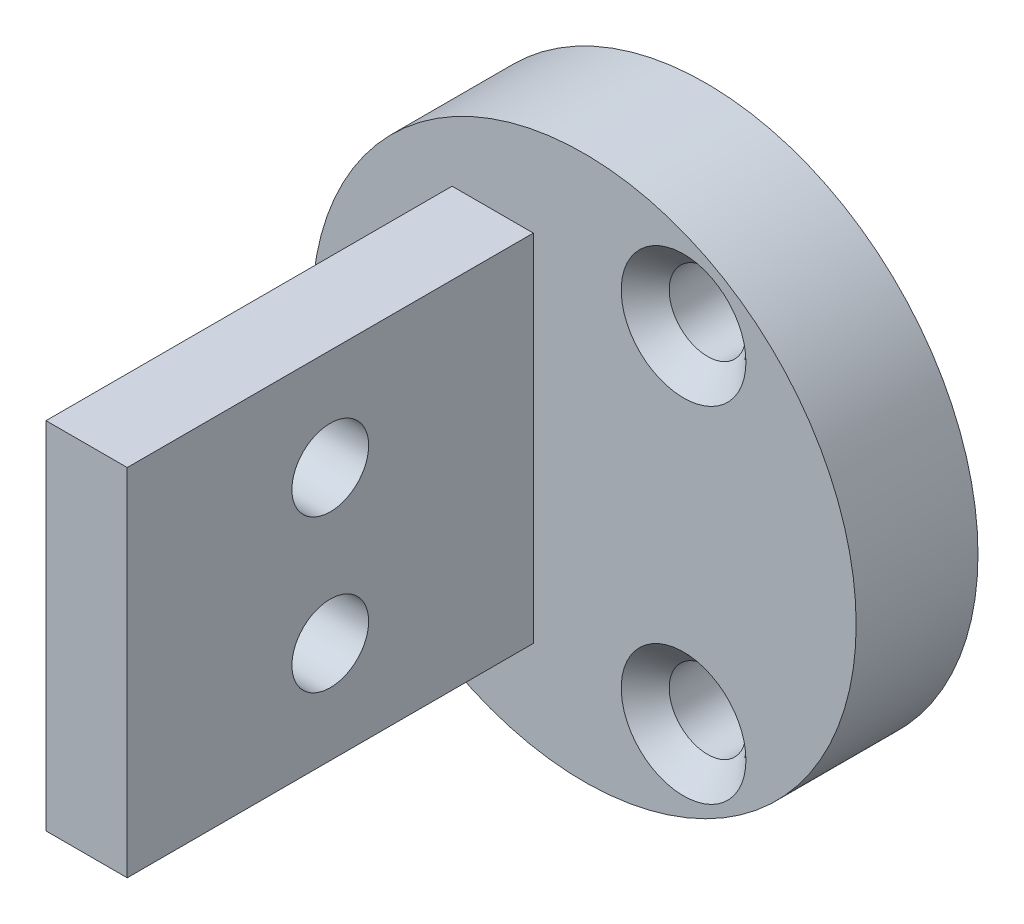
ISO-10303-21;
HEADER;
FILE_DESCRIPTION(('STEP AP214'),'2;1');
FILE_NAME('part.step','',(''),(''),'','','');
FILE_SCHEMA(('AUTOMOTIVE_DESIGN { 1 0 10303 214 1 1 1 1 }'));
ENDSEC;
DATA;
#1=APPLICATION_CONTEXT('core data for automotive mechanical design processes');
#2=APPLICATION_PROTOCOL_DEFINITION('international standard','automotive_design',2000,#1);
#3=PRODUCT_CONTEXT('',#1,'mechanical');
#4=PRODUCT('Part','Part','',(#3));
#5=PRODUCT_RELATED_PRODUCT_CATEGORY('part','',(#4));
#6=PRODUCT_DEFINITION_FORMATION('','',#4);
#7=PRODUCT_DEFINITION_CONTEXT('part definition',#1,'design');
#8=PRODUCT_DEFINITION('design','',#6,#7);
#9=PRODUCT_DEFINITION_SHAPE('','',#8);
#10=(LENGTH_UNIT() NAMED_UNIT(*) SI_UNIT(.MILLI.,.METRE.));
#11=(NAMED_UNIT(*) PLANE_ANGLE_UNIT() SI_UNIT($,.RADIAN.));
#12=(NAMED_UNIT(*) SI_UNIT($,.STERADIAN.) SOLID_ANGLE_UNIT());
#13=UNCERTAINTY_MEASURE_WITH_UNIT(LENGTH_MEASURE(1.E-05),#10,'distance_accuracy_value','');
#14=(GEOMETRIC_REPRESENTATION_CONTEXT(3) GLOBAL_UNCERTAINTY_ASSIGNED_CONTEXT((#13)) GLOBAL_UNIT_ASSIGNED_CONTEXT((#10,
#11,#12)) REPRESENTATION_CONTEXT('',''));
#15=CARTESIAN_POINT('',(0.,0.,0.));
#16=DIRECTION('',(0.,0.,1.));
#17=DIRECTION('',(1.,0.,0.));
#18=AXIS2_PLACEMENT_3D('',#15,#16,#17);
#19=CARTESIAN_POINT('',(0.,0.,3.81));
#20=DIRECTION('',(0.,0.,1.));
#21=DIRECTION('',(1.,0.,0.));
#22=AXIS2_PLACEMENT_3D('',#19,#20,#21);
#23=PLANE('',#22);
#24=CARTESIAN_POINT('',(-6.223,0.,3.81));
#25=DIRECTION('',(0.,0.,1.));
#26=DIRECTION('',(1.,0.,0.));
#27=AXIS2_PLACEMENT_3D('',#24,#25,#26);
#28=CIRCLE('',#27,1.94999999999999);
#29=CARTESIAN_POINT('',(-4.27300000000001,0.,3.81));
#30=VERTEX_POINT('',#29);
#31=EDGE_CURVE('E11',#30,#30,#28,.F.);
#32=ORIENTED_EDGE('',*,*,#31,.T.);
#33=EDGE_LOOP('',(#32));
#34=FACE_BOUND('',#33,.T.);
#35=CARTESIAN_POINT('',(3.11150000000001,5.38927608775055,3.81));
#36=DIRECTION('',(0.,0.,1.));
#37=DIRECTION('',(1.,0.,0.));
#38=AXIS2_PLACEMENT_3D('',#35,#36,#37);
#39=CIRCLE('',#38,1.94999999999999);
#40=CARTESIAN_POINT('',(5.0615,5.38927608775055,3.81));
#41=VERTEX_POINT('',#40);
#42=EDGE_CURVE('E152',#41,#41,#39,.F.);
#43=ORIENTED_EDGE('',*,*,#42,.T.);
#44=EDGE_LOOP('',(#43));
#45=FACE_BOUND('',#44,.T.);
#46=CARTESIAN_POINT('',(3.11149999999999,-5.38927608775058,3.81));
#47=DIRECTION('',(0.,0.,1.));
#48=DIRECTION('',(1.,0.,0.));
#49=AXIS2_PLACEMENT_3D('',#46,#47,#48);
#50=CIRCLE('',#49,1.94999999999999);
#51=CARTESIAN_POINT('',(5.06149999999998,-5.38927608775058,3.81));
#52=VERTEX_POINT('',#51);
#53=EDGE_CURVE('E144',#52,#52,#50,.F.);
#54=ORIENTED_EDGE('',*,*,#53,.T.);
#55=EDGE_LOOP('',(#54));
#56=FACE_BOUND('',#55,.T.);
#57=CARTESIAN_POINT('',(0.,0.,3.81));
#58=DIRECTION('',(0.,0.,1.));
#59=DIRECTION('',(1.,0.,0.));
#60=AXIS2_PLACEMENT_3D('',#57,#58,#59);
#61=CIRCLE('',#60,8.509);
#62=CARTESIAN_POINT('',(8.509,0.,3.81));
#63=VERTEX_POINT('',#62);
#64=EDGE_CURVE('E133',#63,#63,#61,.T.);
#65=ORIENTED_EDGE('',*,*,#64,.T.);
#66=EDGE_LOOP('',(#65));
#67=FACE_BOUND('',#66,.T.);
#68=DIRECTION('',(1.,0.,0.));
#69=VECTOR('',#68,1.);
#70=CARTESIAN_POINT('',(-4.1275,-5.55625,3.81));
#71=LINE('',#70,#69);
#72=CARTESIAN_POINT('',(-4.1275,-5.55625,3.81));
#73=VERTEX_POINT('',#72);
#74=CARTESIAN_POINT('',(-1.5875,-5.55625,3.81));
#75=VERTEX_POINT('',#74);
#76=EDGE_CURVE('E100',#73,#75,#71,.T.);
#77=ORIENTED_EDGE('',*,*,#76,.F.);
#78=DIRECTION('',(0.,-1.,0.));
#79=VECTOR('',#78,1.);
#80=CARTESIAN_POINT('',(-4.1275,5.55625,3.81));
#81=LINE('',#80,#79);
#82=CARTESIAN_POINT('',(-4.1275,5.55625,3.81));
#83=VERTEX_POINT('',#82);
#84=EDGE_CURVE('E114',#83,#73,#81,.T.);
#85=ORIENTED_EDGE('',*,*,#84,.F.);
#86=DIRECTION('',(-1.,0.,0.));
#87=VECTOR('',#86,1.);
#88=CARTESIAN_POINT('',(-4.1275,5.55625,3.81));
#89=LINE('',#88,#87);
#90=CARTESIAN_POINT('',(-1.5875,5.55625,3.81));
#91=VERTEX_POINT('',#90);
#92=EDGE_CURVE('E80',#91,#83,#89,.T.);
#93=ORIENTED_EDGE('',*,*,#92,.F.);
#94=DIRECTION('',(0.,1.,0.));
#95=VECTOR('',#94,1.);
#96=CARTESIAN_POINT('',(-1.5875,5.55625,3.81));
#97=LINE('',#96,#95);
#98=EDGE_CURVE('E121',#75,#91,#97,.T.);
#99=ORIENTED_EDGE('',*,*,#98,.F.);
#100=EDGE_LOOP('',(#77,#85,#93,#99));
#101=FACE_BOUND('',#100,.T.);
#102=ADVANCED_FACE('F41',(#34,#45,#56,#67,#101),#23,.T.);
#103=CARTESIAN_POINT('',(0.,0.,3.81));
#104=DIRECTION('',(0.,0.,-1.));
#105=DIRECTION('',(-1.,0.,0.));
#106=AXIS2_PLACEMENT_3D('',#103,#104,#105);
#107=CYLINDRICAL_SURFACE('',#106,8.509);
#108=ORIENTED_EDGE('',*,*,#64,.F.);
#109=EDGE_LOOP('',(#108));
#110=FACE_BOUND('',#109,.T.);
#111=CARTESIAN_POINT('',(0.,0.,0.));
#112=DIRECTION('',(0.,0.,1.));
#113=DIRECTION('',(1.,0.,0.));
#114=AXIS2_PLACEMENT_3D('',#111,#112,#113);
#115=CIRCLE('',#114,8.509);
#116=CARTESIAN_POINT('',(8.509,0.,0.));
#117=VERTEX_POINT('',#116);
#118=EDGE_CURVE('E132',#117,#117,#115,.T.);
#119=ORIENTED_EDGE('',*,*,#118,.T.);
#120=EDGE_LOOP('',(#119));
#121=FACE_BOUND('',#120,.T.);
#122=ADVANCED_FACE('F172',(#110,#121),#107,.T.);
#123=CARTESIAN_POINT('',(0.,0.,0.));
#124=DIRECTION('',(0.,0.,1.));
#125=DIRECTION('',(1.,0.,0.));
#126=AXIS2_PLACEMENT_3D('',#123,#124,#125);
#127=PLANE('',#126);
#128=CARTESIAN_POINT('',(-6.223,0.,0.));
#129=DIRECTION('',(0.,0.,1.));
#130=DIRECTION('',(1.,0.,0.));
#131=AXIS2_PLACEMENT_3D('',#128,#129,#130);
#132=CIRCLE('',#131,1.2);
#133=CARTESIAN_POINT('',(-5.023,0.,0.));
#134=VERTEX_POINT('',#133);
#135=EDGE_CURVE('E225',#134,#134,#132,.T.);
#136=ORIENTED_EDGE('',*,*,#135,.T.);
#137=EDGE_LOOP('',(#136));
#138=FACE_BOUND('',#137,.T.);
#139=CARTESIAN_POINT('',(3.11150000000001,5.38927608775055,0.));
#140=DIRECTION('',(0.,0.,1.));
#141=DIRECTION('',(1.,0.,0.));
#142=AXIS2_PLACEMENT_3D('',#139,#140,#141);
#143=CIRCLE('',#142,1.2);
#144=CARTESIAN_POINT('',(4.31150000000001,5.38927608775055,0.));
#145=VERTEX_POINT('',#144);
#146=EDGE_CURVE('E221',#145,#145,#143,.T.);
#147=ORIENTED_EDGE('',*,*,#146,.T.);
#148=EDGE_LOOP('',(#147));
#149=FACE_BOUND('',#148,.T.);
#150=CARTESIAN_POINT('',(3.11149999999999,-5.38927608775058,0.));
#151=DIRECTION('',(0.,0.,1.));
#152=DIRECTION('',(1.,0.,0.));
#153=AXIS2_PLACEMENT_3D('',#150,#151,#152);
#154=CIRCLE('',#153,1.2);
#155=CARTESIAN_POINT('',(4.31149999999999,-5.38927608775058,0.));
#156=VERTEX_POINT('',#155);
#157=EDGE_CURVE('E118',#156,#156,#154,.T.);
#158=ORIENTED_EDGE('',*,*,#157,.T.);
#159=EDGE_LOOP('',(#158));
#160=FACE_BOUND('',#159,.T.);
#161=ORIENTED_EDGE('',*,*,#118,.F.);
#162=EDGE_LOOP('',(#161));
#163=FACE_BOUND('',#162,.T.);
#164=ADVANCED_FACE('F180',(#138,#149,#160,#163),#127,.F.);
#165=CARTESIAN_POINT('',(-4.1275,5.55625,16.51));
#166=DIRECTION('',(1.,0.,0.));
#167=DIRECTION('',(0.,1.,0.));
#168=AXIS2_PLACEMENT_3D('',#165,#166,#167);
#169=PLANE('',#168);
#170=CARTESIAN_POINT('',(-4.1275,-2.38125,10.16));
#171=DIRECTION('',(1.,0.,0.));
#172=DIRECTION('',(0.,1.,0.));
#173=AXIS2_PLACEMENT_3D('',#170,#171,#172);
#174=CIRCLE('',#173,1.19999999999999);
#175=CARTESIAN_POINT('',(-4.1275,-1.18125000000001,10.16));
#176=VERTEX_POINT('',#175);
#177=EDGE_CURVE('E240',#176,#176,#174,.T.);
#178=ORIENTED_EDGE('',*,*,#177,.T.);
#179=EDGE_LOOP('',(#178));
#180=FACE_BOUND('',#179,.T.);
#181=CARTESIAN_POINT('',(-4.1275,2.38125,10.16));
#182=DIRECTION('',(1.,0.,0.));
#183=DIRECTION('',(0.,1.,0.));
#184=AXIS2_PLACEMENT_3D('',#181,#182,#183);
#185=CIRCLE('',#184,1.19999999999999);
#186=CARTESIAN_POINT('',(-4.1275,3.58124999999999,10.16));
#187=VERTEX_POINT('',#186);
#188=EDGE_CURVE('E232',#187,#187,#185,.T.);
#189=ORIENTED_EDGE('',*,*,#188,.T.);
#190=EDGE_LOOP('',(#189));
#191=FACE_BOUND('',#190,.T.);
#192=ORIENTED_EDGE('',*,*,#84,.T.);
#193=DIRECTION('',(0.,0.,-1.));
#194=VECTOR('',#193,1.);
#195=CARTESIAN_POINT('',(-4.1275,-5.55625,16.51));
#196=LINE('',#195,#194);
#197=CARTESIAN_POINT('',(-4.1275,-5.55625,16.51));
#198=VERTEX_POINT('',#197);
#199=EDGE_CURVE('E104',#198,#73,#196,.T.);
#200=ORIENTED_EDGE('',*,*,#199,.F.);
#201=DIRECTION('',(0.,-1.,0.));
#202=VECTOR('',#201,1.);
#203=CARTESIAN_POINT('',(-4.1275,5.55625,16.51));
#204=LINE('',#203,#202);
#205=CARTESIAN_POINT('',(-4.1275,5.55625,16.51));
#206=VERTEX_POINT('',#205);
#207=EDGE_CURVE('E92',#206,#198,#204,.T.);
#208=ORIENTED_EDGE('',*,*,#207,.F.);
#209=DIRECTION('',(0.,0.,-1.));
#210=VECTOR('',#209,1.);
#211=CARTESIAN_POINT('',(-4.1275,5.55625,16.51));
#212=LINE('',#211,#210);
#213=EDGE_CURVE('E110',#206,#83,#212,.T.);
#214=ORIENTED_EDGE('',*,*,#213,.T.);
#215=EDGE_LOOP('',(#192,#200,#208,#214));
#216=FACE_BOUND('',#215,.T.);
#217=ADVANCED_FACE('F186',(#180,#191,#216),#169,.F.);
#218=CARTESIAN_POINT('',(-4.1275,-5.55625,16.51));
#219=DIRECTION('',(0.,1.,0.));
#220=DIRECTION('',(0.,0.,1.));
#221=AXIS2_PLACEMENT_3D('',#218,#219,#220);
#222=PLANE('',#221);
#223=ORIENTED_EDGE('',*,*,#76,.T.);
#224=DIRECTION('',(0.,0.,-1.));
#225=VECTOR('',#224,1.);
#226=CARTESIAN_POINT('',(-1.5875,-5.55625,16.51));
#227=LINE('',#226,#225);
#228=CARTESIAN_POINT('',(-1.5875,-5.55625,16.51));
#229=VERTEX_POINT('',#228);
#230=EDGE_CURVE('E97',#229,#75,#227,.T.);
#231=ORIENTED_EDGE('',*,*,#230,.F.);
#232=DIRECTION('',(1.,0.,0.));
#233=VECTOR('',#232,1.);
#234=CARTESIAN_POINT('',(-4.1275,-5.55625,16.51));
#235=LINE('',#234,#233);
#236=EDGE_CURVE('E87',#198,#229,#235,.T.);
#237=ORIENTED_EDGE('',*,*,#236,.F.);
#238=ORIENTED_EDGE('',*,*,#199,.T.);
#239=EDGE_LOOP('',(#223,#231,#237,#238));
#240=FACE_BOUND('',#239,.T.);
#241=ADVANCED_FACE('F98',(#240),#222,.F.);
#242=CARTESIAN_POINT('',(-1.5875,5.55625,16.51));
#243=DIRECTION('',(-1.,0.,0.));
#244=DIRECTION('',(0.,-1.,0.));
#245=AXIS2_PLACEMENT_3D('',#242,#243,#244);
#246=PLANE('',#245);
#247=CARTESIAN_POINT('',(-1.5875,-2.38125,10.16));
#248=DIRECTION('',(1.,0.,0.));
#249=DIRECTION('',(0.,0.,-1.));
#250=AXIS2_PLACEMENT_3D('',#247,#248,#249);
#251=CIRCLE('',#250,1.19999999999999);
#252=CARTESIAN_POINT('',(-1.5875,-2.38125,8.96000000000001));
#253=VERTEX_POINT('',#252);
#254=EDGE_CURVE('E244',#253,#253,#251,.T.);
#255=ORIENTED_EDGE('',*,*,#254,.F.);
#256=EDGE_LOOP('',(#255));
#257=FACE_BOUND('',#256,.T.);
#258=CARTESIAN_POINT('',(-1.5875,2.38125,10.16));
#259=DIRECTION('',(1.,0.,0.));
#260=DIRECTION('',(0.,0.,-1.));
#261=AXIS2_PLACEMENT_3D('',#258,#259,#260);
#262=CIRCLE('',#261,1.19999999999999);
#263=CARTESIAN_POINT('',(-1.5875,2.38125,8.96000000000001));
#264=VERTEX_POINT('',#263);
#265=EDGE_CURVE('E236',#264,#264,#262,.T.);
#266=ORIENTED_EDGE('',*,*,#265,.F.);
#267=EDGE_LOOP('',(#266));
#268=FACE_BOUND('',#267,.T.);
#269=ORIENTED_EDGE('',*,*,#98,.T.);
#270=DIRECTION('',(0.,0.,-1.));
#271=VECTOR('',#270,1.);
#272=CARTESIAN_POINT('',(-1.5875,5.55625,16.51));
#273=LINE('',#272,#271);
#274=CARTESIAN_POINT('',(-1.5875,5.55625,16.51));
#275=VERTEX_POINT('',#274);
#276=EDGE_CURVE('E58',#275,#91,#273,.T.);
#277=ORIENTED_EDGE('',*,*,#276,.F.);
#278=DIRECTION('',(0.,1.,0.));
#279=VECTOR('',#278,1.);
#280=CARTESIAN_POINT('',(-1.5875,5.55625,16.51));
#281=LINE('',#280,#279);
#282=EDGE_CURVE('E90',#229,#275,#281,.T.);
#283=ORIENTED_EDGE('',*,*,#282,.F.);
#284=ORIENTED_EDGE('',*,*,#230,.T.);
#285=EDGE_LOOP('',(#269,#277,#283,#284));
#286=FACE_BOUND('',#285,.T.);
#287=ADVANCED_FACE('F106',(#257,#268,#286),#246,.F.);
#288=CARTESIAN_POINT('',(-4.1275,5.55625,16.51));
#289=DIRECTION('',(0.,-1.,0.));
#290=DIRECTION('',(0.,0.,-1.));
#291=AXIS2_PLACEMENT_3D('',#288,#289,#290);
#292=PLANE('',#291);
#293=ORIENTED_EDGE('',*,*,#92,.T.);
#294=ORIENTED_EDGE('',*,*,#213,.F.);
#295=DIRECTION('',(-1.,0.,0.));
#296=VECTOR('',#295,1.);
#297=CARTESIAN_POINT('',(-4.1275,5.55625,16.51));
#298=LINE('',#297,#296);
#299=EDGE_CURVE('E66',#275,#206,#298,.T.);
#300=ORIENTED_EDGE('',*,*,#299,.F.);
#301=ORIENTED_EDGE('',*,*,#276,.T.);
#302=EDGE_LOOP('',(#293,#294,#300,#301));
#303=FACE_BOUND('',#302,.T.);
#304=ADVANCED_FACE('F252',(#303),#292,.F.);
#305=CARTESIAN_POINT('',(0.,0.,16.51));
#306=DIRECTION('',(0.,0.,1.));
#307=DIRECTION('',(1.,0.,0.));
#308=AXIS2_PLACEMENT_3D('',#305,#306,#307);
#309=PLANE('',#308);
#310=ORIENTED_EDGE('',*,*,#207,.T.);
#311=ORIENTED_EDGE('',*,*,#236,.T.);
#312=ORIENTED_EDGE('',*,*,#282,.T.);
#313=ORIENTED_EDGE('',*,*,#299,.T.);
#314=EDGE_LOOP('',(#310,#311,#312,#313));
#315=FACE_BOUND('',#314,.T.);
#316=ADVANCED_FACE('F88',(#315),#309,.T.);
#317=CARTESIAN_POINT('',(3.11149999999999,-5.38927608775058,3.81));
#318=DIRECTION('',(0.,0.,1.));
#319=DIRECTION('',(1.,0.,0.));
#320=AXIS2_PLACEMENT_3D('',#317,#318,#319);
#321=CYLINDRICAL_SURFACE('',#320,1.19999999999999);
#322=CARTESIAN_POINT('',(3.11149999999999,-5.38927608775058,3.06));
#323=DIRECTION('',(0.,0.,1.));
#324=DIRECTION('',(1.,0.,0.));
#325=AXIS2_PLACEMENT_3D('',#322,#323,#324);
#326=CIRCLE('',#325,1.19999999999999);
#327=CARTESIAN_POINT('',(4.31149999999999,-5.38927608775058,3.06));
#328=VERTEX_POINT('',#327);
#329=EDGE_CURVE('E137',#328,#328,#326,.T.);
#330=ORIENTED_EDGE('',*,*,#329,.T.);
#331=EDGE_LOOP('',(#330));
#332=FACE_BOUND('',#331,.T.);
#333=ORIENTED_EDGE('',*,*,#157,.F.);
#334=EDGE_LOOP('',(#333));
#335=FACE_BOUND('',#334,.T.);
#336=ADVANCED_FACE('F212',(#332,#335),#321,.F.);
#337=CARTESIAN_POINT('',(3.11150000000001,5.38927608775055,3.81));
#338=DIRECTION('',(0.,0.,1.));
#339=DIRECTION('',(1.,0.,0.));
#340=AXIS2_PLACEMENT_3D('',#337,#338,#339);
#341=CYLINDRICAL_SURFACE('',#340,1.19999999999999);
#342=CARTESIAN_POINT('',(3.11150000000001,5.38927608775055,3.06));
#343=DIRECTION('',(0.,0.,1.));
#344=DIRECTION('',(1.,0.,0.));
#345=AXIS2_PLACEMENT_3D('',#342,#343,#344);
#346=CIRCLE('',#345,1.19999999999999);
#347=CARTESIAN_POINT('',(4.3115,5.38927608775055,3.06));
#348=VERTEX_POINT('',#347);
#349=EDGE_CURVE('E148',#348,#348,#346,.T.);
#350=ORIENTED_EDGE('',*,*,#349,.T.);
#351=EDGE_LOOP('',(#350));
#352=FACE_BOUND('',#351,.T.);
#353=ORIENTED_EDGE('',*,*,#146,.F.);
#354=EDGE_LOOP('',(#353));
#355=FACE_BOUND('',#354,.T.);
#356=ADVANCED_FACE('F215',(#352,#355),#341,.F.);
#357=CARTESIAN_POINT('',(-6.223,0.,3.81));
#358=DIRECTION('',(0.,0.,1.));
#359=DIRECTION('',(1.,0.,0.));
#360=AXIS2_PLACEMENT_3D('',#357,#358,#359);
#361=CYLINDRICAL_SURFACE('',#360,1.19999999999999);
#362=CARTESIAN_POINT('',(-6.223,0.,3.06));
#363=DIRECTION('',(0.,0.,1.));
#364=DIRECTION('',(1.,0.,0.));
#365=AXIS2_PLACEMENT_3D('',#362,#363,#364);
#366=CIRCLE('',#365,1.19999999999999);
#367=CARTESIAN_POINT('',(-5.02300000000001,0.,3.06));
#368=VERTEX_POINT('',#367);
#369=EDGE_CURVE('E51',#368,#368,#366,.T.);
#370=ORIENTED_EDGE('',*,*,#369,.T.);
#371=EDGE_LOOP('',(#370));
#372=FACE_BOUND('',#371,.T.);
#373=ORIENTED_EDGE('',*,*,#135,.F.);
#374=EDGE_LOOP('',(#373));
#375=FACE_BOUND('',#374,.T.);
#376=ADVANCED_FACE('F159',(#372,#375),#361,.F.);
#377=CARTESIAN_POINT('',(-1.5875,2.38125,10.16));
#378=DIRECTION('',(1.,0.,0.));
#379=DIRECTION('',(0.,0.,-1.));
#380=AXIS2_PLACEMENT_3D('',#377,#378,#379);
#381=CYLINDRICAL_SURFACE('',#380,1.19999999999999);
#382=ORIENTED_EDGE('',*,*,#265,.T.);
#383=EDGE_LOOP('',(#382));
#384=FACE_BOUND('',#383,.T.);
#385=ORIENTED_EDGE('',*,*,#188,.F.);
#386=EDGE_LOOP('',(#385));
#387=FACE_BOUND('',#386,.T.);
#388=ADVANCED_FACE('F205',(#384,#387),#381,.F.);
#389=CARTESIAN_POINT('',(-1.5875,-2.38125,10.16));
#390=DIRECTION('',(1.,0.,0.));
#391=DIRECTION('',(0.,0.,-1.));
#392=AXIS2_PLACEMENT_3D('',#389,#390,#391);
#393=CYLINDRICAL_SURFACE('',#392,1.19999999999999);
#394=ORIENTED_EDGE('',*,*,#254,.T.);
#395=EDGE_LOOP('',(#394));
#396=FACE_BOUND('',#395,.T.);
#397=ORIENTED_EDGE('',*,*,#177,.F.);
#398=EDGE_LOOP('',(#397));
#399=FACE_BOUND('',#398,.T.);
#400=ADVANCED_FACE('F196',(#396,#399),#393,.F.);
#401=CARTESIAN_POINT('',(3.11149999999999,-5.38927608775058,3.06));
#402=DIRECTION('',(0.,0.,1.));
#403=DIRECTION('',(1.,0.,0.));
#404=AXIS2_PLACEMENT_3D('',#401,#402,#403);
#405=CONICAL_SURFACE('',#404,1.19999999999999,0.785398163397448);
#406=ORIENTED_EDGE('',*,*,#53,.F.);
#407=EDGE_LOOP('',(#406));
#408=FACE_BOUND('',#407,.T.);
#409=ORIENTED_EDGE('',*,*,#329,.F.);
#410=EDGE_LOOP('',(#409));
#411=FACE_BOUND('',#410,.T.);
#412=ADVANCED_FACE('F168',(#408,#411),#405,.F.);
#413=CARTESIAN_POINT('',(3.11150000000001,5.38927608775055,3.06));
#414=DIRECTION('',(0.,0.,1.));
#415=DIRECTION('',(1.,0.,0.));
#416=AXIS2_PLACEMENT_3D('',#413,#414,#415);
#417=CONICAL_SURFACE('',#416,1.19999999999999,0.785398163397448);
#418=ORIENTED_EDGE('',*,*,#42,.F.);
#419=EDGE_LOOP('',(#418));
#420=FACE_BOUND('',#419,.T.);
#421=ORIENTED_EDGE('',*,*,#349,.F.);
#422=EDGE_LOOP('',(#421));
#423=FACE_BOUND('',#422,.T.);
#424=ADVANCED_FACE('F163',(#420,#423),#417,.F.);
#425=CARTESIAN_POINT('',(-6.223,0.,3.06));
#426=DIRECTION('',(0.,0.,1.));
#427=DIRECTION('',(1.,0.,0.));
#428=AXIS2_PLACEMENT_3D('',#425,#426,#427);
#429=CONICAL_SURFACE('',#428,1.19999999999999,0.785398163397448);
#430=ORIENTED_EDGE('',*,*,#31,.F.);
#431=EDGE_LOOP('',(#430));
#432=FACE_BOUND('',#431,.T.);
#433=ORIENTED_EDGE('',*,*,#369,.F.);
#434=EDGE_LOOP('',(#433));
#435=FACE_BOUND('',#434,.T.);
#436=ADVANCED_FACE('F44',(#432,#435),#429,.F.);
#437=CLOSED_SHELL('',(#102,#122,#164,#217,#241,#287,#304,#316,#336,#356,#376,#388,#400,#412,
#424,#436));
#438=MANIFOLD_SOLID_BREP('B2',#437);
#439=ADVANCED_BREP_SHAPE_REPRESENTATION('',(#18,#438),#14);
#440=SHAPE_DEFINITION_REPRESENTATION(#9,#439);
ENDSEC;
END-ISO-10303-21;
